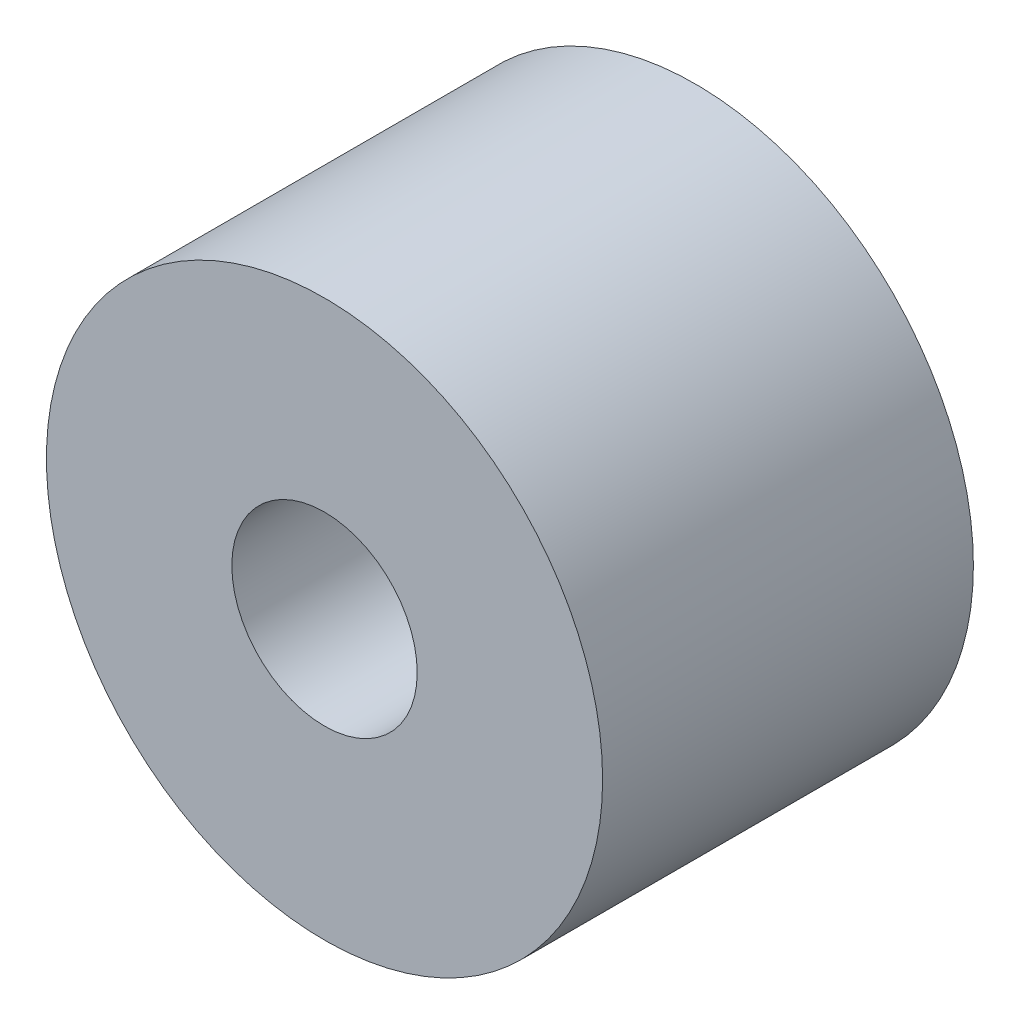
ISO-10303-21;
HEADER;
FILE_DESCRIPTION(('STEP AP214'),'2;1');
FILE_NAME('part.step','',(''),(''),'','','');
FILE_SCHEMA(('AUTOMOTIVE_DESIGN { 1 0 10303 214 1 1 1 1 }'));
ENDSEC;
DATA;
#1=APPLICATION_CONTEXT('core data for automotive mechanical design processes');
#2=APPLICATION_PROTOCOL_DEFINITION('international standard','automotive_design',2000,#1);
#3=PRODUCT_CONTEXT('',#1,'mechanical');
#4=PRODUCT('Part','Part','',(#3));
#5=PRODUCT_RELATED_PRODUCT_CATEGORY('part','',(#4));
#6=PRODUCT_DEFINITION_FORMATION('','',#4);
#7=PRODUCT_DEFINITION_CONTEXT('part definition',#1,'design');
#8=PRODUCT_DEFINITION('design','',#6,#7);
#9=PRODUCT_DEFINITION_SHAPE('','',#8);
#10=(LENGTH_UNIT() NAMED_UNIT(*) SI_UNIT(.MILLI.,.METRE.));
#11=(NAMED_UNIT(*) PLANE_ANGLE_UNIT() SI_UNIT($,.RADIAN.));
#12=(NAMED_UNIT(*) SI_UNIT($,.STERADIAN.) SOLID_ANGLE_UNIT());
#13=UNCERTAINTY_MEASURE_WITH_UNIT(LENGTH_MEASURE(1.E-05),#10,'distance_accuracy_value','');
#14=(GEOMETRIC_REPRESENTATION_CONTEXT(3) GLOBAL_UNCERTAINTY_ASSIGNED_CONTEXT((#13)) GLOBAL_UNIT_ASSIGNED_CONTEXT((#10,
#11,#12)) REPRESENTATION_CONTEXT('',''));
#15=CARTESIAN_POINT('',(0.,0.,0.));
#16=DIRECTION('',(0.,0.,1.));
#17=DIRECTION('',(1.,0.,0.));
#18=AXIS2_PLACEMENT_3D('',#15,#16,#17);
#19=CARTESIAN_POINT('',(0.,0.,20.));
#20=DIRECTION('',(0.,0.,-1.));
#21=DIRECTION('',(-1.,0.,0.));
#22=AXIS2_PLACEMENT_3D('',#19,#20,#21);
#23=CYLINDRICAL_SURFACE('',#22,15.);
#24=CARTESIAN_POINT('',(0.,0.,20.));
#25=DIRECTION('',(0.,0.,1.));
#26=DIRECTION('',(1.,0.,0.));
#27=AXIS2_PLACEMENT_3D('',#24,#25,#26);
#28=CIRCLE('',#27,15.);
#29=CARTESIAN_POINT('',(15.,0.,20.));
#30=VERTEX_POINT('',#29);
#31=EDGE_CURVE('E10',#30,#30,#28,.T.);
#32=ORIENTED_EDGE('',*,*,#31,.F.);
#33=EDGE_LOOP('',(#32));
#34=FACE_BOUND('',#33,.T.);
#35=CARTESIAN_POINT('',(0.,0.,0.));
#36=DIRECTION('',(0.,0.,1.));
#37=DIRECTION('',(1.,0.,0.));
#38=AXIS2_PLACEMENT_3D('',#35,#36,#37);
#39=CIRCLE('',#38,15.);
#40=CARTESIAN_POINT('',(15.,0.,0.));
#41=VERTEX_POINT('',#40);
#42=EDGE_CURVE('E35',#41,#41,#39,.T.);
#43=ORIENTED_EDGE('',*,*,#42,.T.);
#44=EDGE_LOOP('',(#43));
#45=FACE_BOUND('',#44,.T.);
#46=ADVANCED_FACE('F32',(#34,#45),#23,.T.);
#47=CARTESIAN_POINT('',(0.,0.,20.));
#48=DIRECTION('',(0.,0.,1.));
#49=DIRECTION('',(1.,0.,0.));
#50=AXIS2_PLACEMENT_3D('',#47,#48,#49);
#51=PLANE('',#50);
#52=CARTESIAN_POINT('',(0.,0.,20.));
#53=DIRECTION('',(0.,0.,1.));
#54=DIRECTION('',(1.,0.,0.));
#55=AXIS2_PLACEMENT_3D('',#52,#53,#54);
#56=CIRCLE('',#55,5.);
#57=CARTESIAN_POINT('',(5.,0.,20.));
#58=VERTEX_POINT('',#57);
#59=EDGE_CURVE('E44',#58,#58,#56,.T.);
#60=ORIENTED_EDGE('',*,*,#59,.F.);
#61=EDGE_LOOP('',(#60));
#62=FACE_BOUND('',#61,.T.);
#63=ORIENTED_EDGE('',*,*,#31,.T.);
#64=EDGE_LOOP('',(#63));
#65=FACE_BOUND('',#64,.T.);
#66=ADVANCED_FACE('F59',(#62,#65),#51,.T.);
#67=CARTESIAN_POINT('',(0.,0.,0.));
#68=DIRECTION('',(0.,0.,1.));
#69=DIRECTION('',(1.,0.,0.));
#70=AXIS2_PLACEMENT_3D('',#67,#68,#69);
#71=PLANE('',#70);
#72=ORIENTED_EDGE('',*,*,#42,.F.);
#73=EDGE_LOOP('',(#72));
#74=FACE_BOUND('',#73,.T.);
#75=ADVANCED_FACE('F55',(#74),#71,.F.);
#76=CARTESIAN_POINT('',(0.,0.,10.));
#77=DIRECTION('',(0.,0.,1.));
#78=DIRECTION('',(1.,0.,0.));
#79=AXIS2_PLACEMENT_3D('',#76,#77,#78);
#80=CYLINDRICAL_SURFACE('',#79,5.);
#81=CARTESIAN_POINT('',(0.,0.,10.));
#82=DIRECTION('',(0.,0.,1.));
#83=DIRECTION('',(1.,0.,0.));
#84=AXIS2_PLACEMENT_3D('',#81,#82,#83);
#85=CIRCLE('',#84,5.);
#86=CARTESIAN_POINT('',(5.,0.,10.));
#87=VERTEX_POINT('',#86);
#88=EDGE_CURVE('E42',#87,#87,#85,.T.);
#89=ORIENTED_EDGE('',*,*,#88,.F.);
#90=EDGE_LOOP('',(#89));
#91=FACE_BOUND('',#90,.T.);
#92=ORIENTED_EDGE('',*,*,#59,.T.);
#93=EDGE_LOOP('',(#92));
#94=FACE_BOUND('',#93,.T.);
#95=ADVANCED_FACE('F52',(#91,#94),#80,.F.);
#96=CARTESIAN_POINT('',(0.,0.,10.));
#97=DIRECTION('',(0.,0.,1.));
#98=DIRECTION('',(1.,0.,0.));
#99=AXIS2_PLACEMENT_3D('',#96,#97,#98);
#100=PLANE('',#99);
#101=ORIENTED_EDGE('',*,*,#88,.T.);
#102=EDGE_LOOP('',(#101));
#103=FACE_BOUND('',#102,.T.);
#104=ADVANCED_FACE('F50',(#103),#100,.T.);
#105=CLOSED_SHELL('',(#46,#66,#75,#95,#104));
#106=MANIFOLD_SOLID_BREP('B2',#105);
#107=ADVANCED_BREP_SHAPE_REPRESENTATION('',(#18,#106),#14);
#108=SHAPE_DEFINITION_REPRESENTATION(#9,#107);
ENDSEC;
END-ISO-10303-21;
